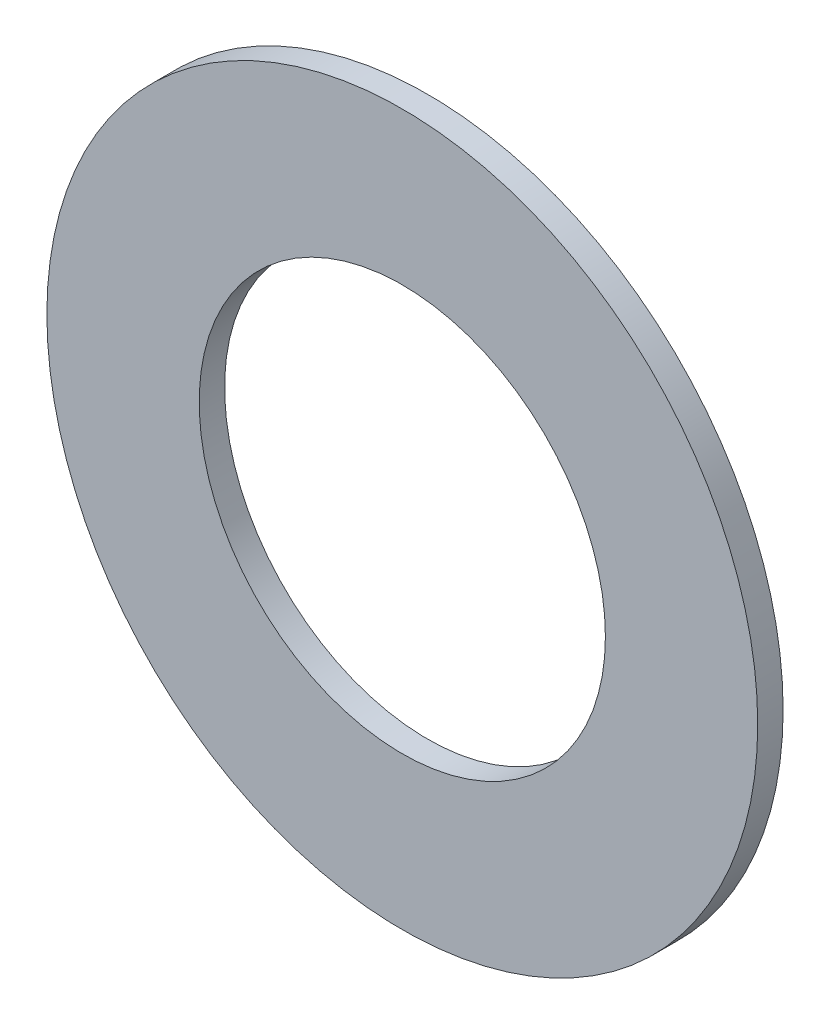
ISO-10303-21;
HEADER;
FILE_DESCRIPTION(('STEP AP214'),'2;1');
FILE_NAME('part.step','',(''),(''),'','','');
FILE_SCHEMA(('AUTOMOTIVE_DESIGN { 1 0 10303 214 1 1 1 1 }'));
ENDSEC;
DATA;
#1=APPLICATION_CONTEXT('core data for automotive mechanical design processes');
#2=APPLICATION_PROTOCOL_DEFINITION('international standard','automotive_design',2000,#1);
#3=PRODUCT_CONTEXT('',#1,'mechanical');
#4=PRODUCT('Part','Part','',(#3));
#5=PRODUCT_RELATED_PRODUCT_CATEGORY('part','',(#4));
#6=PRODUCT_DEFINITION_FORMATION('','',#4);
#7=PRODUCT_DEFINITION_CONTEXT('part definition',#1,'design');
#8=PRODUCT_DEFINITION('design','',#6,#7);
#9=PRODUCT_DEFINITION_SHAPE('','',#8);
#10=(LENGTH_UNIT() NAMED_UNIT(*) SI_UNIT(.MILLI.,.METRE.));
#11=(NAMED_UNIT(*) PLANE_ANGLE_UNIT() SI_UNIT($,.RADIAN.));
#12=(NAMED_UNIT(*) SI_UNIT($,.STERADIAN.) SOLID_ANGLE_UNIT());
#13=UNCERTAINTY_MEASURE_WITH_UNIT(LENGTH_MEASURE(1.E-05),#10,'distance_accuracy_value','');
#14=(GEOMETRIC_REPRESENTATION_CONTEXT(3) GLOBAL_UNCERTAINTY_ASSIGNED_CONTEXT((#13)) GLOBAL_UNIT_ASSIGNED_CONTEXT((#10,
#11,#12)) REPRESENTATION_CONTEXT('',''));
#15=CARTESIAN_POINT('',(0.,0.,0.));
#16=DIRECTION('',(0.,0.,1.));
#17=DIRECTION('',(1.,0.,0.));
#18=AXIS2_PLACEMENT_3D('',#15,#16,#17);
#19=CARTESIAN_POINT('',(0.,0.,0.5));
#20=DIRECTION('',(0.,0.,1.));
#21=DIRECTION('',(1.,0.,0.));
#22=AXIS2_PLACEMENT_3D('',#19,#20,#21);
#23=PLANE('',#22);
#24=CARTESIAN_POINT('',(0.,0.,0.5));
#25=DIRECTION('',(0.,0.,1.));
#26=DIRECTION('',(1.,0.,0.));
#27=AXIS2_PLACEMENT_3D('',#24,#25,#26);
#28=CIRCLE('',#27,7.);
#29=CARTESIAN_POINT('',(7.,0.,0.5));
#30=VERTEX_POINT('',#29);
#31=EDGE_CURVE('E10',#30,#30,#28,.T.);
#32=ORIENTED_EDGE('',*,*,#31,.T.);
#33=EDGE_LOOP('',(#32));
#34=FACE_BOUND('',#33,.T.);
#35=CARTESIAN_POINT('',(0.,0.,0.5));
#36=DIRECTION('',(0.,0.,1.));
#37=DIRECTION('',(1.,0.,0.));
#38=AXIS2_PLACEMENT_3D('',#35,#36,#37);
#39=CIRCLE('',#38,4.);
#40=CARTESIAN_POINT('',(4.,0.,0.5));
#41=VERTEX_POINT('',#40);
#42=EDGE_CURVE('E41',#41,#41,#39,.T.);
#43=ORIENTED_EDGE('',*,*,#42,.F.);
#44=EDGE_LOOP('',(#43));
#45=FACE_BOUND('',#44,.T.);
#46=ADVANCED_FACE('F30',(#34,#45),#23,.T.);
#47=CARTESIAN_POINT('',(0.,0.,0.));
#48=DIRECTION('',(0.,0.,1.));
#49=DIRECTION('',(1.,0.,0.));
#50=AXIS2_PLACEMENT_3D('',#47,#48,#49);
#51=PLANE('',#50);
#52=CARTESIAN_POINT('',(0.,0.,0.));
#53=DIRECTION('',(0.,0.,1.));
#54=DIRECTION('',(1.,0.,0.));
#55=AXIS2_PLACEMENT_3D('',#52,#53,#54);
#56=CIRCLE('',#55,7.);
#57=CARTESIAN_POINT('',(7.,0.,0.));
#58=VERTEX_POINT('',#57);
#59=EDGE_CURVE('E34',#58,#58,#56,.T.);
#60=ORIENTED_EDGE('',*,*,#59,.F.);
#61=EDGE_LOOP('',(#60));
#62=FACE_BOUND('',#61,.T.);
#63=CARTESIAN_POINT('',(0.,0.,0.));
#64=DIRECTION('',(0.,0.,1.));
#65=DIRECTION('',(1.,0.,0.));
#66=AXIS2_PLACEMENT_3D('',#63,#64,#65);
#67=CIRCLE('',#66,4.);
#68=CARTESIAN_POINT('',(4.,0.,0.));
#69=VERTEX_POINT('',#68);
#70=EDGE_CURVE('E43',#69,#69,#67,.T.);
#71=ORIENTED_EDGE('',*,*,#70,.T.);
#72=EDGE_LOOP('',(#71));
#73=FACE_BOUND('',#72,.T.);
#74=ADVANCED_FACE('F53',(#62,#73),#51,.F.);
#75=CARTESIAN_POINT('',(0.,0.,0.5));
#76=DIRECTION('',(0.,0.,-1.));
#77=DIRECTION('',(-1.,0.,0.));
#78=AXIS2_PLACEMENT_3D('',#75,#76,#77);
#79=CYLINDRICAL_SURFACE('',#78,7.);
#80=ORIENTED_EDGE('',*,*,#31,.F.);
#81=EDGE_LOOP('',(#80));
#82=FACE_BOUND('',#81,.T.);
#83=ORIENTED_EDGE('',*,*,#59,.T.);
#84=EDGE_LOOP('',(#83));
#85=FACE_BOUND('',#84,.T.);
#86=ADVANCED_FACE('F32',(#82,#85),#79,.T.);
#87=CARTESIAN_POINT('',(0.,0.,0.5));
#88=DIRECTION('',(0.,0.,-1.));
#89=DIRECTION('',(-1.,0.,0.));
#90=AXIS2_PLACEMENT_3D('',#87,#88,#89);
#91=CYLINDRICAL_SURFACE('',#90,4.);
#92=ORIENTED_EDGE('',*,*,#42,.T.);
#93=EDGE_LOOP('',(#92));
#94=FACE_BOUND('',#93,.T.);
#95=ORIENTED_EDGE('',*,*,#70,.F.);
#96=EDGE_LOOP('',(#95));
#97=FACE_BOUND('',#96,.T.);
#98=ADVANCED_FACE('F49',(#94,#97),#91,.F.);
#99=CLOSED_SHELL('',(#46,#74,#86,#98));
#100=MANIFOLD_SOLID_BREP('B2',#99);
#101=ADVANCED_BREP_SHAPE_REPRESENTATION('',(#18,#100),#14);
#102=SHAPE_DEFINITION_REPRESENTATION(#9,#101);
ENDSEC;
END-ISO-10303-21;
